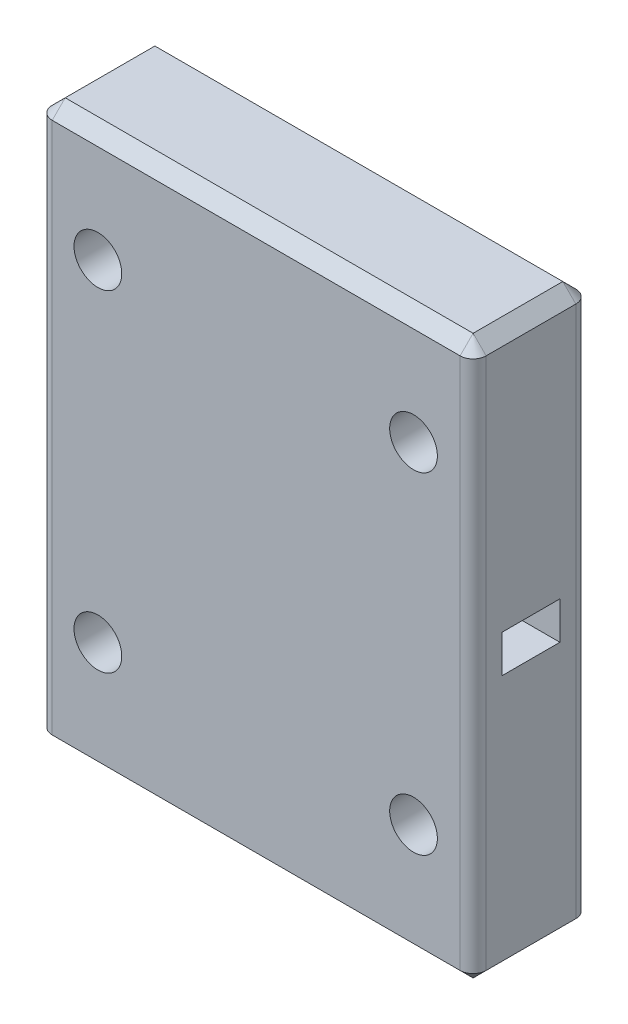
ISO-10303-21;
HEADER;
FILE_DESCRIPTION(('STEP AP214'),'2;1');
FILE_NAME('part.step','',(''),(''),'','','');
FILE_SCHEMA(('AUTOMOTIVE_DESIGN { 1 0 10303 214 1 1 1 1 }'));
ENDSEC;
DATA;
#1=APPLICATION_CONTEXT('core data for automotive mechanical design processes');
#2=APPLICATION_PROTOCOL_DEFINITION('international standard','automotive_design',2000,#1);
#3=PRODUCT_CONTEXT('',#1,'mechanical');
#4=PRODUCT('Part','Part','',(#3));
#5=PRODUCT_RELATED_PRODUCT_CATEGORY('part','',(#4));
#6=PRODUCT_DEFINITION_FORMATION('','',#4);
#7=PRODUCT_DEFINITION_CONTEXT('part definition',#1,'design');
#8=PRODUCT_DEFINITION('design','',#6,#7);
#9=PRODUCT_DEFINITION_SHAPE('','',#8);
#10=(LENGTH_UNIT() NAMED_UNIT(*) SI_UNIT(.MILLI.,.METRE.));
#11=(NAMED_UNIT(*) PLANE_ANGLE_UNIT() SI_UNIT($,.RADIAN.));
#12=(NAMED_UNIT(*) SI_UNIT($,.STERADIAN.) SOLID_ANGLE_UNIT());
#13=UNCERTAINTY_MEASURE_WITH_UNIT(LENGTH_MEASURE(1.E-05),#10,'distance_accuracy_value','');
#14=(GEOMETRIC_REPRESENTATION_CONTEXT(3) GLOBAL_UNCERTAINTY_ASSIGNED_CONTEXT((#13)) GLOBAL_UNIT_ASSIGNED_CONTEXT((#10,
#11,#12)) REPRESENTATION_CONTEXT('',''));
#15=CARTESIAN_POINT('',(0.,0.,0.));
#16=DIRECTION('',(0.,0.,1.));
#17=DIRECTION('',(1.,0.,0.));
#18=AXIS2_PLACEMENT_3D('',#15,#16,#17);
#19=CARTESIAN_POINT('',(15.0433857381665,64.262,1.57056150970451));
#20=DIRECTION('',(0.,-1.,0.));
#21=DIRECTION('',(0.,0.,-1.));
#22=AXIS2_PLACEMENT_3D('',#19,#20,#21);
#23=CYLINDRICAL_SURFACE('',#22,1.143);
#24=DIRECTION('',(0.,-1.,0.));
#25=VECTOR('',#24,1.);
#26=CARTESIAN_POINT('',(16.1863857381665,64.262,1.57056150970451));
#27=LINE('',#26,#25);
#28=CARTESIAN_POINT('',(16.1863857381665,63.119,1.57056150970451));
#29=VERTEX_POINT('',#28);
#30=CARTESIAN_POINT('',(16.1863857381665,16.383,1.57056150970451));
#31=VERTEX_POINT('',#30);
#32=EDGE_CURVE('E196',#29,#31,#27,.T.);
#33=ORIENTED_EDGE('',*,*,#32,.T.);
#34=CARTESIAN_POINT('',(15.0433857381665,16.383,1.57056150970451));
#35=DIRECTION('',(0.,-1.,0.));
#36=DIRECTION('',(0.,0.,-1.));
#37=AXIS2_PLACEMENT_3D('',#34,#35,#36);
#38=CIRCLE('',#37,1.143);
#39=CARTESIAN_POINT('',(15.0433857381665,16.383,0.427561509704508));
#40=VERTEX_POINT('',#39);
#41=EDGE_CURVE('E239',#31,#40,#38,.F.);
#42=ORIENTED_EDGE('',*,*,#41,.T.);
#43=DIRECTION('',(0.,-1.,0.));
#44=VECTOR('',#43,1.);
#45=CARTESIAN_POINT('',(15.0433857381665,64.262,0.427561509704508));
#46=LINE('',#45,#44);
#47=CARTESIAN_POINT('',(15.0433857381665,63.119,0.427561509704508));
#48=VERTEX_POINT('',#47);
#49=EDGE_CURVE('E220',#48,#40,#46,.T.);
#50=ORIENTED_EDGE('',*,*,#49,.F.);
#51=CARTESIAN_POINT('',(15.0433857381665,63.119,1.57056150970451));
#52=DIRECTION('',(0.,-1.,0.));
#53=DIRECTION('',(0.,0.,-1.));
#54=AXIS2_PLACEMENT_3D('',#51,#52,#53);
#55=CIRCLE('',#54,1.143);
#56=EDGE_CURVE('E237',#48,#29,#55,.T.);
#57=ORIENTED_EDGE('',*,*,#56,.T.);
#58=EDGE_LOOP('',(#33,#42,#50,#57));
#59=FACE_BOUND('',#58,.T.);
#60=ADVANCED_FACE('F36',(#59),#23,.T.);
#61=CARTESIAN_POINT('',(15.0433857381665,64.262,0.427561509704508));
#62=DIRECTION('',(0.,0.,1.));
#63=DIRECTION('',(1.,0.,0.));
#64=AXIS2_PLACEMENT_3D('',#61,#62,#63);
#65=PLANE('',#64);
#66=CARTESIAN_POINT('',(10.9541062388225,25.4254000031227,0.427561509704508));
#67=DIRECTION('',(0.,0.,-1.));
#68=DIRECTION('',(-1.,0.,0.));
#69=AXIS2_PLACEMENT_3D('',#66,#67,#68);
#70=CIRCLE('',#69,2.0955);
#71=CARTESIAN_POINT('',(8.85860623882254,25.4254000031227,0.427561509704508));
#72=VERTEX_POINT('',#71);
#73=EDGE_CURVE('E693',#72,#72,#70,.T.);
#74=ORIENTED_EDGE('',*,*,#73,.F.);
#75=EDGE_LOOP('',(#74));
#76=FACE_BOUND('',#75,.T.);
#77=CARTESIAN_POINT('',(-16.7572937614626,54.5083999971114,0.427561509704508));
#78=DIRECTION('',(0.,0.,-1.));
#79=DIRECTION('',(-1.,0.,0.));
#80=AXIS2_PLACEMENT_3D('',#77,#78,#79);
#81=CIRCLE('',#80,2.0955);
#82=CARTESIAN_POINT('',(-18.8527937614626,54.5083999971114,0.427561509704508));
#83=VERTEX_POINT('',#82);
#84=EDGE_CURVE('E695',#83,#83,#81,.T.);
#85=ORIENTED_EDGE('',*,*,#84,.F.);
#86=EDGE_LOOP('',(#85));
#87=FACE_BOUND('',#86,.T.);
#88=CARTESIAN_POINT('',(-16.7572937614626,25.4254000031227,0.427561509704508));
#89=DIRECTION('',(0.,0.,-1.));
#90=DIRECTION('',(-1.,0.,0.));
#91=AXIS2_PLACEMENT_3D('',#88,#89,#90);
#92=CIRCLE('',#91,2.0955);
#93=CARTESIAN_POINT('',(-18.8527937614626,25.4254000031227,0.427561509704508));
#94=VERTEX_POINT('',#93);
#95=EDGE_CURVE('E707',#94,#94,#92,.T.);
#96=ORIENTED_EDGE('',*,*,#95,.F.);
#97=EDGE_LOOP('',(#96));
#98=FACE_BOUND('',#97,.T.);
#99=CARTESIAN_POINT('',(10.9541062388225,54.5083999971114,0.427561509704508));
#100=DIRECTION('',(0.,0.,-1.));
#101=DIRECTION('',(-1.,0.,0.));
#102=AXIS2_PLACEMENT_3D('',#99,#100,#101);
#103=CIRCLE('',#102,2.0955);
#104=CARTESIAN_POINT('',(8.85860623882255,54.5083999971114,0.427561509704508));
#105=VERTEX_POINT('',#104);
#106=EDGE_CURVE('E700',#105,#105,#103,.T.);
#107=ORIENTED_EDGE('',*,*,#106,.F.);
#108=EDGE_LOOP('',(#107));
#109=FACE_BOUND('',#108,.T.);
#110=ORIENTED_EDGE('',*,*,#49,.T.);
#111=DIRECTION('',(-1.,0.,0.));
#112=VECTOR('',#111,1.);
#113=CARTESIAN_POINT('',(-20.7706142618335,16.383,0.427561509704508));
#114=LINE('',#113,#112);
#115=CARTESIAN_POINT('',(-20.7706142618335,16.383,0.427561509704508));
#116=VERTEX_POINT('',#115);
#117=EDGE_CURVE('E248',#40,#116,#114,.T.);
#118=ORIENTED_EDGE('',*,*,#117,.T.);
#119=DIRECTION('',(0.,-1.,0.));
#120=VECTOR('',#119,1.);
#121=CARTESIAN_POINT('',(-20.7706142618335,64.262,0.427561509704508));
#122=LINE('',#121,#120);
#123=CARTESIAN_POINT('',(-20.7706142618335,63.119,0.427561509704508));
#124=VERTEX_POINT('',#123);
#125=EDGE_CURVE('E217',#124,#116,#122,.T.);
#126=ORIENTED_EDGE('',*,*,#125,.F.);
#127=DIRECTION('',(1.,0.,0.));
#128=VECTOR('',#127,1.);
#129=CARTESIAN_POINT('',(15.0433857381665,63.119,0.427561509704508));
#130=LINE('',#129,#128);
#131=EDGE_CURVE('E245',#124,#48,#130,.T.);
#132=ORIENTED_EDGE('',*,*,#131,.T.);
#133=EDGE_LOOP('',(#110,#118,#126,#132));
#134=FACE_BOUND('',#133,.T.);
#135=ADVANCED_FACE('F360',(#76,#87,#98,#109,#134),#65,.F.);
#136=CARTESIAN_POINT('',(-20.7706142618335,64.262,1.57056150970451));
#137=DIRECTION('',(0.,-1.,0.));
#138=DIRECTION('',(0.,0.,-1.));
#139=AXIS2_PLACEMENT_3D('',#136,#137,#138);
#140=CYLINDRICAL_SURFACE('',#139,1.143);
#141=ORIENTED_EDGE('',*,*,#125,.T.);
#142=CARTESIAN_POINT('',(-20.7706142618335,16.383,1.57056150970451));
#143=DIRECTION('',(0.,-1.,0.));
#144=DIRECTION('',(0.,0.,-1.));
#145=AXIS2_PLACEMENT_3D('',#142,#143,#144);
#146=CIRCLE('',#145,1.143);
#147=CARTESIAN_POINT('',(-21.9136142618335,16.383,1.57056150970451));
#148=VERTEX_POINT('',#147);
#149=EDGE_CURVE('E256',#116,#148,#146,.F.);
#150=ORIENTED_EDGE('',*,*,#149,.T.);
#151=DIRECTION('',(0.,-1.,0.));
#152=VECTOR('',#151,1.);
#153=CARTESIAN_POINT('',(-21.9136142618335,64.262,1.57056150970451));
#154=LINE('',#153,#152);
#155=CARTESIAN_POINT('',(-21.9136142618335,63.119,1.57056150970451));
#156=VERTEX_POINT('',#155);
#157=EDGE_CURVE('E214',#156,#148,#154,.T.);
#158=ORIENTED_EDGE('',*,*,#157,.F.);
#159=CARTESIAN_POINT('',(-20.7706142618335,63.119,1.57056150970451));
#160=DIRECTION('',(0.,-1.,0.));
#161=DIRECTION('',(0.,0.,-1.));
#162=AXIS2_PLACEMENT_3D('',#159,#160,#161);
#163=CIRCLE('',#162,1.143);
#164=EDGE_CURVE('E254',#156,#124,#163,.T.);
#165=ORIENTED_EDGE('',*,*,#164,.T.);
#166=EDGE_LOOP('',(#141,#150,#158,#165));
#167=FACE_BOUND('',#166,.T.);
#168=ADVANCED_FACE('F372',(#167),#140,.T.);
#169=CARTESIAN_POINT('',(-21.9136142618335,64.262,1.57056150970451));
#170=DIRECTION('',(1.,0.,0.));
#171=DIRECTION('',(0.,0.,-1.));
#172=AXIS2_PLACEMENT_3D('',#169,#170,#171);
#173=PLANE('',#172);
#174=ORIENTED_EDGE('',*,*,#157,.T.);
#175=DIRECTION('',(0.,0.,1.));
#176=VECTOR('',#175,1.);
#177=CARTESIAN_POINT('',(-21.9136142618335,16.383,9.4445615097045));
#178=LINE('',#177,#176);
#179=CARTESIAN_POINT('',(-21.9136142618335,16.383,9.4445615097045));
#180=VERTEX_POINT('',#179);
#181=EDGE_CURVE('E264',#148,#180,#178,.T.);
#182=ORIENTED_EDGE('',*,*,#181,.T.);
#183=DIRECTION('',(0.,-1.,0.));
#184=VECTOR('',#183,1.);
#185=CARTESIAN_POINT('',(-21.9136142618335,64.262,9.4445615097045));
#186=LINE('',#185,#184);
#187=CARTESIAN_POINT('',(-21.9136142618335,63.119,9.4445615097045));
#188=VERTEX_POINT('',#187);
#189=EDGE_CURVE('E211',#188,#180,#186,.T.);
#190=ORIENTED_EDGE('',*,*,#189,.F.);
#191=DIRECTION('',(0.,0.,-1.));
#192=VECTOR('',#191,1.);
#193=CARTESIAN_POINT('',(-21.9136142618335,63.119,1.57056150970451));
#194=LINE('',#193,#192);
#195=EDGE_CURVE('E262',#188,#156,#194,.T.);
#196=ORIENTED_EDGE('',*,*,#195,.T.);
#197=EDGE_LOOP('',(#174,#182,#190,#196));
#198=FACE_BOUND('',#197,.T.);
#199=ADVANCED_FACE('F376',(#198),#173,.F.);
#200=CARTESIAN_POINT('',(-20.7706142618335,64.262,9.4445615097045));
#201=DIRECTION('',(0.,-1.,0.));
#202=DIRECTION('',(0.,0.,-1.));
#203=AXIS2_PLACEMENT_3D('',#200,#201,#202);
#204=CYLINDRICAL_SURFACE('',#203,1.143);
#205=ORIENTED_EDGE('',*,*,#189,.T.);
#206=CARTESIAN_POINT('',(-20.7706142618335,16.383,9.4445615097045));
#207=DIRECTION('',(0.,-1.,0.));
#208=DIRECTION('',(0.,0.,-1.));
#209=AXIS2_PLACEMENT_3D('',#206,#207,#208);
#210=CIRCLE('',#209,1.143);
#211=CARTESIAN_POINT('',(-20.7706142618335,16.383,10.5875615097045));
#212=VERTEX_POINT('',#211);
#213=EDGE_CURVE('E260',#180,#212,#210,.F.);
#214=ORIENTED_EDGE('',*,*,#213,.T.);
#215=DIRECTION('',(0.,-1.,0.));
#216=VECTOR('',#215,1.);
#217=CARTESIAN_POINT('',(-20.7706142618335,64.262,10.5875615097045));
#218=LINE('',#217,#216);
#219=CARTESIAN_POINT('',(-20.7706142618335,63.119,10.5875615097045));
#220=VERTEX_POINT('',#219);
#221=EDGE_CURVE('E208',#220,#212,#218,.T.);
#222=ORIENTED_EDGE('',*,*,#221,.F.);
#223=CARTESIAN_POINT('',(-20.7706142618335,63.119,9.4445615097045));
#224=DIRECTION('',(0.,-1.,0.));
#225=DIRECTION('',(0.,0.,-1.));
#226=AXIS2_PLACEMENT_3D('',#223,#224,#225);
#227=CIRCLE('',#226,1.143);
#228=EDGE_CURVE('E258',#220,#188,#227,.T.);
#229=ORIENTED_EDGE('',*,*,#228,.T.);
#230=EDGE_LOOP('',(#205,#214,#222,#229));
#231=FACE_BOUND('',#230,.T.);
#232=ADVANCED_FACE('F325',(#231),#204,.T.);
#233=CARTESIAN_POINT('',(15.0433857381665,64.262,10.5875615097045));
#234=DIRECTION('',(0.,0.,-1.));
#235=DIRECTION('',(-1.,0.,0.));
#236=AXIS2_PLACEMENT_3D('',#233,#234,#235);
#237=PLANE('',#236);
#238=CARTESIAN_POINT('',(10.9541062388225,25.4254000031227,10.5875615097045));
#239=DIRECTION('',(0.,0.,-1.));
#240=DIRECTION('',(-1.,0.,0.));
#241=AXIS2_PLACEMENT_3D('',#238,#239,#240);
#242=CIRCLE('',#241,2.0955);
#243=CARTESIAN_POINT('',(8.85860623882254,25.4254000031227,10.5875615097045));
#244=VERTEX_POINT('',#243);
#245=EDGE_CURVE('E690',#244,#244,#242,.F.);
#246=ORIENTED_EDGE('',*,*,#245,.F.);
#247=EDGE_LOOP('',(#246));
#248=FACE_BOUND('',#247,.T.);
#249=CARTESIAN_POINT('',(-16.7572937614626,54.5083999971114,10.5875615097045));
#250=DIRECTION('',(0.,0.,-1.));
#251=DIRECTION('',(-1.,0.,0.));
#252=AXIS2_PLACEMENT_3D('',#249,#250,#251);
#253=CIRCLE('',#252,2.0955);
#254=CARTESIAN_POINT('',(-18.8527937614626,54.5083999971114,10.5875615097045));
#255=VERTEX_POINT('',#254);
#256=EDGE_CURVE('E698',#255,#255,#253,.F.);
#257=ORIENTED_EDGE('',*,*,#256,.F.);
#258=EDGE_LOOP('',(#257));
#259=FACE_BOUND('',#258,.T.);
#260=CARTESIAN_POINT('',(-16.7572937614626,25.4254000031227,10.5875615097045));
#261=DIRECTION('',(0.,0.,-1.));
#262=DIRECTION('',(-1.,0.,0.));
#263=AXIS2_PLACEMENT_3D('',#260,#261,#262);
#264=CIRCLE('',#263,2.0955);
#265=CARTESIAN_POINT('',(-18.8527937614626,25.4254000031227,10.5875615097045));
#266=VERTEX_POINT('',#265);
#267=EDGE_CURVE('E702',#266,#266,#264,.F.);
#268=ORIENTED_EDGE('',*,*,#267,.F.);
#269=EDGE_LOOP('',(#268));
#270=FACE_BOUND('',#269,.T.);
#271=CARTESIAN_POINT('',(10.9541062388225,54.5083999971114,10.5875615097045));
#272=DIRECTION('',(0.,0.,-1.));
#273=DIRECTION('',(-1.,0.,0.));
#274=AXIS2_PLACEMENT_3D('',#271,#272,#273);
#275=CIRCLE('',#274,2.0955);
#276=CARTESIAN_POINT('',(8.85860623882255,54.5083999971114,10.5875615097045));
#277=VERTEX_POINT('',#276);
#278=EDGE_CURVE('E183',#277,#277,#275,.F.);
#279=ORIENTED_EDGE('',*,*,#278,.F.);
#280=EDGE_LOOP('',(#279));
#281=FACE_BOUND('',#280,.T.);
#282=ORIENTED_EDGE('',*,*,#221,.T.);
#283=DIRECTION('',(1.,0.,0.));
#284=VECTOR('',#283,1.);
#285=CARTESIAN_POINT('',(15.0433857381665,16.383,10.5875615097045));
#286=LINE('',#285,#284);
#287=CARTESIAN_POINT('',(15.0433857381665,16.383,10.5875615097045));
#288=VERTEX_POINT('',#287);
#289=EDGE_CURVE('E252',#212,#288,#286,.T.);
#290=ORIENTED_EDGE('',*,*,#289,.T.);
#291=DIRECTION('',(0.,-1.,0.));
#292=VECTOR('',#291,1.);
#293=CARTESIAN_POINT('',(15.0433857381665,64.262,10.5875615097045));
#294=LINE('',#293,#292);
#295=CARTESIAN_POINT('',(15.0433857381665,63.119,10.5875615097045));
#296=VERTEX_POINT('',#295);
#297=EDGE_CURVE('E205',#296,#288,#294,.T.);
#298=ORIENTED_EDGE('',*,*,#297,.F.);
#299=DIRECTION('',(-1.,0.,0.));
#300=VECTOR('',#299,1.);
#301=CARTESIAN_POINT('',(15.0433857381665,63.119,10.5875615097045));
#302=LINE('',#301,#300);
#303=EDGE_CURVE('E250',#296,#220,#302,.T.);
#304=ORIENTED_EDGE('',*,*,#303,.T.);
#305=EDGE_LOOP('',(#282,#290,#298,#304));
#306=FACE_BOUND('',#305,.T.);
#307=ADVANCED_FACE('F322',(#248,#259,#270,#281,#306),#237,.F.);
#308=CARTESIAN_POINT('',(15.0433857381665,64.262,9.4445615097045));
#309=DIRECTION('',(0.,-1.,0.));
#310=DIRECTION('',(0.,0.,-1.));
#311=AXIS2_PLACEMENT_3D('',#308,#309,#310);
#312=CYLINDRICAL_SURFACE('',#311,1.143);
#313=ORIENTED_EDGE('',*,*,#297,.T.);
#314=CARTESIAN_POINT('',(15.0433857381665,16.383,9.4445615097045));
#315=DIRECTION('',(0.,-1.,0.));
#316=DIRECTION('',(0.,0.,-1.));
#317=AXIS2_PLACEMENT_3D('',#314,#315,#316);
#318=CIRCLE('',#317,1.143);
#319=CARTESIAN_POINT('',(16.1863857381665,16.383,9.4445615097045));
#320=VERTEX_POINT('',#319);
#321=EDGE_CURVE('E243',#288,#320,#318,.F.);
#322=ORIENTED_EDGE('',*,*,#321,.T.);
#323=DIRECTION('',(0.,-1.,0.));
#324=VECTOR('',#323,1.);
#325=CARTESIAN_POINT('',(16.1863857381665,64.262,9.4445615097045));
#326=LINE('',#325,#324);
#327=CARTESIAN_POINT('',(16.1863857381665,63.119,9.4445615097045));
#328=VERTEX_POINT('',#327);
#329=EDGE_CURVE('E202',#328,#320,#326,.T.);
#330=ORIENTED_EDGE('',*,*,#329,.F.);
#331=CARTESIAN_POINT('',(15.0433857381665,63.119,9.4445615097045));
#332=DIRECTION('',(0.,-1.,0.));
#333=DIRECTION('',(0.,0.,-1.));
#334=AXIS2_PLACEMENT_3D('',#331,#332,#333);
#335=CIRCLE('',#334,1.143);
#336=EDGE_CURVE('E241',#328,#296,#335,.T.);
#337=ORIENTED_EDGE('',*,*,#336,.T.);
#338=EDGE_LOOP('',(#313,#322,#330,#337));
#339=FACE_BOUND('',#338,.T.);
#340=ADVANCED_FACE('F338',(#339),#312,.T.);
#341=CARTESIAN_POINT('',(16.1863857381665,64.262,1.57056150970451));
#342=DIRECTION('',(-1.,0.,0.));
#343=DIRECTION('',(0.,0.,1.));
#344=AXIS2_PLACEMENT_3D('',#341,#342,#343);
#345=PLANE('',#344);
#346=DIRECTION('',(0.,0.,-1.));
#347=VECTOR('',#346,1.);
#348=CARTESIAN_POINT('',(16.1863857381665,38.1,8.0475615097045));
#349=LINE('',#348,#347);
#350=CARTESIAN_POINT('',(16.1863857381665,38.1,8.0475615097045));
#351=VERTEX_POINT('',#350);
#352=CARTESIAN_POINT('',(16.1863857381665,38.1,2.96756150970451));
#353=VERTEX_POINT('',#352);
#354=EDGE_CURVE('E189',#351,#353,#349,.T.);
#355=ORIENTED_EDGE('',*,*,#354,.F.);
#356=DIRECTION('',(0.,-1.,0.));
#357=VECTOR('',#356,1.);
#358=CARTESIAN_POINT('',(16.1863857381665,41.402,8.04756150970451));
#359=LINE('',#358,#357);
#360=CARTESIAN_POINT('',(16.1863857381665,41.402,8.04756150970451));
#361=VERTEX_POINT('',#360);
#362=EDGE_CURVE('E160',#361,#351,#359,.T.);
#363=ORIENTED_EDGE('',*,*,#362,.F.);
#364=DIRECTION('',(0.,0.,1.));
#365=VECTOR('',#364,1.);
#366=CARTESIAN_POINT('',(16.1863857381665,41.402,8.04756150970451));
#367=LINE('',#366,#365);
#368=CARTESIAN_POINT('',(16.1863857381665,41.402,2.96756150970451));
#369=VERTEX_POINT('',#368);
#370=EDGE_CURVE('E177',#369,#361,#367,.T.);
#371=ORIENTED_EDGE('',*,*,#370,.F.);
#372=DIRECTION('',(0.,1.,0.));
#373=VECTOR('',#372,1.);
#374=CARTESIAN_POINT('',(16.1863857381665,41.402,2.96756150970451));
#375=LINE('',#374,#373);
#376=EDGE_CURVE('E180',#353,#369,#375,.T.);
#377=ORIENTED_EDGE('',*,*,#376,.F.);
#378=EDGE_LOOP('',(#355,#363,#371,#377));
#379=FACE_BOUND('',#378,.T.);
#380=ORIENTED_EDGE('',*,*,#329,.T.);
#381=DIRECTION('',(0.,0.,-1.));
#382=VECTOR('',#381,1.);
#383=CARTESIAN_POINT('',(16.1863857381665,16.383,1.57056150970451));
#384=LINE('',#383,#382);
#385=EDGE_CURVE('E225',#320,#31,#384,.T.);
#386=ORIENTED_EDGE('',*,*,#385,.T.);
#387=ORIENTED_EDGE('',*,*,#32,.F.);
#388=DIRECTION('',(0.,0.,1.));
#389=VECTOR('',#388,1.);
#390=CARTESIAN_POINT('',(16.1863857381665,63.119,1.57056150970451));
#391=LINE('',#390,#389);
#392=EDGE_CURVE('E223',#29,#328,#391,.T.);
#393=ORIENTED_EDGE('',*,*,#392,.T.);
#394=EDGE_LOOP('',(#380,#386,#387,#393));
#395=FACE_BOUND('',#394,.T.);
#396=ADVANCED_FACE('F342',(#379,#395),#345,.F.);
#397=CARTESIAN_POINT('',(15.0433857381665,64.262,1.57056150970451));
#398=DIRECTION('',(0.,-1.,0.));
#399=DIRECTION('',(0.,0.,-1.));
#400=AXIS2_PLACEMENT_3D('',#397,#398,#399);
#401=PLANE('',#400);
#402=DIRECTION('',(0.,0.,-1.));
#403=VECTOR('',#402,1.);
#404=CARTESIAN_POINT('',(15.0433857381665,64.262,1.57056150970451));
#405=LINE('',#404,#403);
#406=CARTESIAN_POINT('',(15.0433857381665,64.262,9.4445615097045));
#407=VERTEX_POINT('',#406);
#408=CARTESIAN_POINT('',(15.0433857381665,64.262,1.57056150970451));
#409=VERTEX_POINT('',#408);
#410=EDGE_CURVE('E60',#407,#409,#405,.T.);
#411=ORIENTED_EDGE('',*,*,#410,.T.);
#412=DIRECTION('',(-1.,0.,0.));
#413=VECTOR('',#412,1.);
#414=CARTESIAN_POINT('',(15.0433857381665,64.262,1.57056150970451));
#415=LINE('',#414,#413);
#416=CARTESIAN_POINT('',(-20.7706142618335,64.262,1.57056150970451));
#417=VERTEX_POINT('',#416);
#418=EDGE_CURVE('E11',#409,#417,#415,.T.);
#419=ORIENTED_EDGE('',*,*,#418,.T.);
#420=DIRECTION('',(0.,0.,1.));
#421=VECTOR('',#420,1.);
#422=CARTESIAN_POINT('',(-20.7706142618335,64.262,1.57056150970451));
#423=LINE('',#422,#421);
#424=CARTESIAN_POINT('',(-20.7706142618335,64.262,9.4445615097045));
#425=VERTEX_POINT('',#424);
#426=EDGE_CURVE('E45',#417,#425,#423,.T.);
#427=ORIENTED_EDGE('',*,*,#426,.T.);
#428=DIRECTION('',(1.,0.,0.));
#429=VECTOR('',#428,1.);
#430=CARTESIAN_POINT('',(15.0433857381665,64.262,9.4445615097045));
#431=LINE('',#430,#429);
#432=EDGE_CURVE('E266',#425,#407,#431,.T.);
#433=ORIENTED_EDGE('',*,*,#432,.T.);
#434=EDGE_LOOP('',(#411,#419,#427,#433));
#435=FACE_BOUND('',#434,.T.);
#436=ADVANCED_FACE('F384',(#435),#401,.F.);
#437=CARTESIAN_POINT('',(15.0433857381665,15.24,1.57056150970451));
#438=DIRECTION('',(0.,-1.,0.));
#439=DIRECTION('',(0.,0.,-1.));
#440=AXIS2_PLACEMENT_3D('',#437,#438,#439);
#441=PLANE('',#440);
#442=DIRECTION('',(1.,0.,0.));
#443=VECTOR('',#442,1.);
#444=CARTESIAN_POINT('',(15.0433857381665,15.24,1.57056150970451));
#445=LINE('',#444,#443);
#446=CARTESIAN_POINT('',(-20.7706142618335,15.24,1.57056150970451));
#447=VERTEX_POINT('',#446);
#448=CARTESIAN_POINT('',(15.0433857381665,15.24,1.57056150970451));
#449=VERTEX_POINT('',#448);
#450=EDGE_CURVE('E232',#447,#449,#445,.T.);
#451=ORIENTED_EDGE('',*,*,#450,.T.);
#452=DIRECTION('',(0.,0.,1.));
#453=VECTOR('',#452,1.);
#454=CARTESIAN_POINT('',(15.0433857381665,15.24,9.4445615097045));
#455=LINE('',#454,#453);
#456=CARTESIAN_POINT('',(15.0433857381665,15.24,9.44456150970449));
#457=VERTEX_POINT('',#456);
#458=EDGE_CURVE('E234',#449,#457,#455,.T.);
#459=ORIENTED_EDGE('',*,*,#458,.T.);
#460=DIRECTION('',(-1.,0.,0.));
#461=VECTOR('',#460,1.);
#462=CARTESIAN_POINT('',(-20.7706142618335,15.24,9.44456150970449));
#463=LINE('',#462,#461);
#464=CARTESIAN_POINT('',(-20.7706142618335,15.24,9.4445615097045));
#465=VERTEX_POINT('',#464);
#466=EDGE_CURVE('E230',#457,#465,#463,.T.);
#467=ORIENTED_EDGE('',*,*,#466,.T.);
#468=DIRECTION('',(0.,0.,-1.));
#469=VECTOR('',#468,1.);
#470=CARTESIAN_POINT('',(-20.7706142618335,15.24,1.57056150970451));
#471=LINE('',#470,#469);
#472=EDGE_CURVE('E228',#465,#447,#471,.T.);
#473=ORIENTED_EDGE('',*,*,#472,.T.);
#474=EDGE_LOOP('',(#451,#459,#467,#473));
#475=FACE_BOUND('',#474,.T.);
#476=ADVANCED_FACE('F382',(#475),#441,.T.);
#477=CARTESIAN_POINT('',(8.56638573816653,41.402,8.04756150970451));
#478=DIRECTION('',(0.,0.,1.));
#479=DIRECTION('',(0.,-1.,0.));
#480=AXIS2_PLACEMENT_3D('',#477,#478,#479);
#481=PLANE('',#480);
#482=ORIENTED_EDGE('',*,*,#362,.T.);
#483=DIRECTION('',(1.,0.,0.));
#484=VECTOR('',#483,1.);
#485=CARTESIAN_POINT('',(8.56638573816653,38.1,8.0475615097045));
#486=LINE('',#485,#484);
#487=CARTESIAN_POINT('',(8.56638573816653,38.1,8.0475615097045));
#488=VERTEX_POINT('',#487);
#489=EDGE_CURVE('E153',#488,#351,#486,.T.);
#490=ORIENTED_EDGE('',*,*,#489,.F.);
#491=DIRECTION('',(0.,-1.,0.));
#492=VECTOR('',#491,1.);
#493=CARTESIAN_POINT('',(8.56638573816653,41.402,8.04756150970451));
#494=LINE('',#493,#492);
#495=CARTESIAN_POINT('',(8.56638573816653,41.402,8.04756150970451));
#496=VERTEX_POINT('',#495);
#497=EDGE_CURVE('E157',#496,#488,#494,.T.);
#498=ORIENTED_EDGE('',*,*,#497,.F.);
#499=DIRECTION('',(1.,0.,0.));
#500=VECTOR('',#499,1.);
#501=CARTESIAN_POINT('',(8.56638573816653,41.402,8.04756150970451));
#502=LINE('',#501,#500);
#503=EDGE_CURVE('E194',#496,#361,#502,.T.);
#504=ORIENTED_EDGE('',*,*,#503,.T.);
#505=EDGE_LOOP('',(#482,#490,#498,#504));
#506=FACE_BOUND('',#505,.T.);
#507=ADVANCED_FACE('F155',(#506),#481,.F.);
#508=CARTESIAN_POINT('',(8.56638573816653,41.402,8.04756150970451));
#509=DIRECTION('',(0.,1.,0.));
#510=DIRECTION('',(0.,0.,1.));
#511=AXIS2_PLACEMENT_3D('',#508,#509,#510);
#512=PLANE('',#511);
#513=ORIENTED_EDGE('',*,*,#370,.T.);
#514=ORIENTED_EDGE('',*,*,#503,.F.);
#515=DIRECTION('',(0.,0.,1.));
#516=VECTOR('',#515,1.);
#517=CARTESIAN_POINT('',(8.56638573816653,41.402,8.04756150970451));
#518=LINE('',#517,#516);
#519=CARTESIAN_POINT('',(8.56638573816653,41.402,2.96756150970451));
#520=VERTEX_POINT('',#519);
#521=EDGE_CURVE('E165',#520,#496,#518,.T.);
#522=ORIENTED_EDGE('',*,*,#521,.F.);
#523=DIRECTION('',(1.,0.,0.));
#524=VECTOR('',#523,1.);
#525=CARTESIAN_POINT('',(8.56638573816653,41.402,2.96756150970451));
#526=LINE('',#525,#524);
#527=EDGE_CURVE('E197',#520,#369,#526,.T.);
#528=ORIENTED_EDGE('',*,*,#527,.T.);
#529=EDGE_LOOP('',(#513,#514,#522,#528));
#530=FACE_BOUND('',#529,.T.);
#531=ADVANCED_FACE('F390',(#530),#512,.F.);
#532=CARTESIAN_POINT('',(8.56638573816653,41.402,2.96756150970451));
#533=DIRECTION('',(0.,0.,-1.));
#534=DIRECTION('',(0.,1.,0.));
#535=AXIS2_PLACEMENT_3D('',#532,#533,#534);
#536=PLANE('',#535);
#537=ORIENTED_EDGE('',*,*,#376,.T.);
#538=ORIENTED_EDGE('',*,*,#527,.F.);
#539=DIRECTION('',(0.,1.,0.));
#540=VECTOR('',#539,1.);
#541=CARTESIAN_POINT('',(8.56638573816653,41.402,2.96756150970451));
#542=LINE('',#541,#540);
#543=CARTESIAN_POINT('',(8.56638573816653,38.1,2.96756150970451));
#544=VERTEX_POINT('',#543);
#545=EDGE_CURVE('E173',#544,#520,#542,.T.);
#546=ORIENTED_EDGE('',*,*,#545,.F.);
#547=DIRECTION('',(1.,0.,0.));
#548=VECTOR('',#547,1.);
#549=CARTESIAN_POINT('',(8.56638573816653,38.1,2.96756150970451));
#550=LINE('',#549,#548);
#551=EDGE_CURVE('E164',#544,#353,#550,.T.);
#552=ORIENTED_EDGE('',*,*,#551,.T.);
#553=EDGE_LOOP('',(#537,#538,#546,#552));
#554=FACE_BOUND('',#553,.T.);
#555=ADVANCED_FACE('F501',(#554),#536,.F.);
#556=CARTESIAN_POINT('',(8.56638573816653,38.1,8.0475615097045));
#557=DIRECTION('',(0.,-1.,0.));
#558=DIRECTION('',(0.,0.,-1.));
#559=AXIS2_PLACEMENT_3D('',#556,#557,#558);
#560=PLANE('',#559);
#561=ORIENTED_EDGE('',*,*,#354,.T.);
#562=ORIENTED_EDGE('',*,*,#551,.F.);
#563=DIRECTION('',(0.,0.,-1.));
#564=VECTOR('',#563,1.);
#565=CARTESIAN_POINT('',(8.56638573816653,38.1,8.0475615097045));
#566=LINE('',#565,#564);
#567=EDGE_CURVE('E168',#488,#544,#566,.T.);
#568=ORIENTED_EDGE('',*,*,#567,.F.);
#569=ORIENTED_EDGE('',*,*,#489,.T.);
#570=EDGE_LOOP('',(#561,#562,#568,#569));
#571=FACE_BOUND('',#570,.T.);
#572=ADVANCED_FACE('F169',(#571),#560,.F.);
#573=CARTESIAN_POINT('',(8.56638573816653,0.,0.));
#574=DIRECTION('',(1.,0.,0.));
#575=DIRECTION('',(0.,0.,-1.));
#576=AXIS2_PLACEMENT_3D('',#573,#574,#575);
#577=PLANE('',#576);
#578=ORIENTED_EDGE('',*,*,#497,.T.);
#579=ORIENTED_EDGE('',*,*,#567,.T.);
#580=ORIENTED_EDGE('',*,*,#545,.T.);
#581=ORIENTED_EDGE('',*,*,#521,.T.);
#582=EDGE_LOOP('',(#578,#579,#580,#581));
#583=FACE_BOUND('',#582,.T.);
#584=ADVANCED_FACE('F175',(#583),#577,.T.);
#585=CARTESIAN_POINT('',(-21.9136142618335,16.383,1.57056150970451));
#586=DIRECTION('',(-0.707106781186547,-0.707106781186548,0.));
#587=DIRECTION('',(0.,0.,-1.));
#588=AXIS2_PLACEMENT_3D('',#585,#586,#587);
#589=PLANE('',#588);
#590=DIRECTION('',(0.707106781186548,-0.707106781186547,0.));
#591=VECTOR('',#590,1.);
#592=CARTESIAN_POINT('',(-21.9136142618335,16.383,9.4445615097045));
#593=LINE('',#592,#591);
#594=EDGE_CURVE('E190',#180,#465,#593,.T.);
#595=ORIENTED_EDGE('',*,*,#594,.F.);
#596=ORIENTED_EDGE('',*,*,#181,.F.);
#597=DIRECTION('',(-0.707106781186548,0.707106781186547,0.));
#598=VECTOR('',#597,1.);
#599=CARTESIAN_POINT('',(-20.7706142618335,15.24,1.57056150970451));
#600=LINE('',#599,#598);
#601=EDGE_CURVE('E286',#447,#148,#600,.T.);
#602=ORIENTED_EDGE('',*,*,#601,.F.);
#603=ORIENTED_EDGE('',*,*,#472,.F.);
#604=EDGE_LOOP('',(#595,#596,#602,#603));
#605=FACE_BOUND('',#604,.T.);
#606=ADVANCED_FACE('F379',(#605),#589,.T.);
#607=CARTESIAN_POINT('',(-20.7706142618335,16.383,9.4445615097045));
#608=DIRECTION('',(0.,1.,0.));
#609=DIRECTION('',(0.,0.,1.));
#610=AXIS2_PLACEMENT_3D('',#607,#608,#609);
#611=CONICAL_SURFACE('',#610,1.14300000000001,0.785398163397449);
#612=ORIENTED_EDGE('',*,*,#213,.F.);
#613=ORIENTED_EDGE('',*,*,#594,.T.);
#614=DIRECTION('',(0.,-0.707106781186547,-0.707106781186547));
#615=VECTOR('',#614,1.);
#616=CARTESIAN_POINT('',(-20.7706142618335,16.383,10.5875615097045));
#617=LINE('',#616,#615);
#618=EDGE_CURVE('E283',#212,#465,#617,.T.);
#619=ORIENTED_EDGE('',*,*,#618,.F.);
#620=EDGE_LOOP('',(#612,#613,#619));
#621=FACE_BOUND('',#620,.T.);
#622=ADVANCED_FACE('F330',(#621),#611,.T.);
#623=CARTESIAN_POINT('',(-20.7706142618335,16.383,1.57056150970451));
#624=DIRECTION('',(0.,1.,0.));
#625=DIRECTION('',(0.,0.,1.));
#626=AXIS2_PLACEMENT_3D('',#623,#624,#625);
#627=CONICAL_SURFACE('',#626,1.14300000000001,0.785398163397449);
#628=ORIENTED_EDGE('',*,*,#601,.T.);
#629=ORIENTED_EDGE('',*,*,#149,.F.);
#630=DIRECTION('',(0.,0.707106781186548,-0.707106781186547));
#631=VECTOR('',#630,1.);
#632=CARTESIAN_POINT('',(-20.7706142618335,15.24,1.57056150970451));
#633=LINE('',#632,#631);
#634=EDGE_CURVE('E280',#447,#116,#633,.T.);
#635=ORIENTED_EDGE('',*,*,#634,.F.);
#636=EDGE_LOOP('',(#628,#629,#635));
#637=FACE_BOUND('',#636,.T.);
#638=ADVANCED_FACE('F368',(#637),#627,.T.);
#639=CARTESIAN_POINT('',(15.0433857381665,16.383,10.5875615097045));
#640=DIRECTION('',(0.,-0.707106781186548,0.707106781186547));
#641=DIRECTION('',(-1.,0.,0.));
#642=AXIS2_PLACEMENT_3D('',#639,#640,#641);
#643=PLANE('',#642);
#644=ORIENTED_EDGE('',*,*,#618,.T.);
#645=ORIENTED_EDGE('',*,*,#466,.F.);
#646=DIRECTION('',(0.,-0.707106781186547,-0.707106781186548));
#647=VECTOR('',#646,1.);
#648=CARTESIAN_POINT('',(15.0433857381665,16.383,10.5875615097045));
#649=LINE('',#648,#647);
#650=EDGE_CURVE('E277',#288,#457,#649,.T.);
#651=ORIENTED_EDGE('',*,*,#650,.F.);
#652=ORIENTED_EDGE('',*,*,#289,.F.);
#653=EDGE_LOOP('',(#644,#645,#651,#652));
#654=FACE_BOUND('',#653,.T.);
#655=ADVANCED_FACE('F335',(#654),#643,.T.);
#656=CARTESIAN_POINT('',(15.0433857381665,16.383,0.427561509704508));
#657=DIRECTION('',(0.,-0.707106781186548,-0.707106781186547));
#658=DIRECTION('',(1.,0.,0.));
#659=AXIS2_PLACEMENT_3D('',#656,#657,#658);
#660=PLANE('',#659);
#661=ORIENTED_EDGE('',*,*,#634,.T.);
#662=ORIENTED_EDGE('',*,*,#117,.F.);
#663=DIRECTION('',(0.,0.707106781186547,-0.707106781186548));
#664=VECTOR('',#663,1.);
#665=CARTESIAN_POINT('',(15.0433857381665,15.24,1.57056150970451));
#666=LINE('',#665,#664);
#667=EDGE_CURVE('E274',#449,#40,#666,.T.);
#668=ORIENTED_EDGE('',*,*,#667,.F.);
#669=ORIENTED_EDGE('',*,*,#450,.F.);
#670=EDGE_LOOP('',(#661,#662,#668,#669));
#671=FACE_BOUND('',#670,.T.);
#672=ADVANCED_FACE('F363',(#671),#660,.T.);
#673=CARTESIAN_POINT('',(15.0433857381665,16.383,9.4445615097045));
#674=DIRECTION('',(0.,1.,0.));
#675=DIRECTION('',(0.,0.,1.));
#676=AXIS2_PLACEMENT_3D('',#673,#674,#675);
#677=CONICAL_SURFACE('',#676,1.14300000000001,0.785398163397449);
#678=ORIENTED_EDGE('',*,*,#321,.F.);
#679=ORIENTED_EDGE('',*,*,#650,.T.);
#680=DIRECTION('',(-0.707106781186549,-0.707106781186546,0.));
#681=VECTOR('',#680,1.);
#682=CARTESIAN_POINT('',(16.1863857381665,16.383,9.4445615097045));
#683=LINE('',#682,#681);
#684=EDGE_CURVE('E272',#320,#457,#683,.T.);
#685=ORIENTED_EDGE('',*,*,#684,.F.);
#686=EDGE_LOOP('',(#678,#679,#685));
#687=FACE_BOUND('',#686,.T.);
#688=ADVANCED_FACE('F347',(#687),#677,.T.);
#689=CARTESIAN_POINT('',(15.0433857381665,16.383,1.57056150970451));
#690=DIRECTION('',(0.,1.,0.));
#691=DIRECTION('',(0.,0.,1.));
#692=AXIS2_PLACEMENT_3D('',#689,#690,#691);
#693=CONICAL_SURFACE('',#692,1.14300000000001,0.785398163397449);
#694=ORIENTED_EDGE('',*,*,#667,.T.);
#695=ORIENTED_EDGE('',*,*,#41,.F.);
#696=DIRECTION('',(0.707106781186549,0.707106781186546,0.));
#697=VECTOR('',#696,1.);
#698=CARTESIAN_POINT('',(15.0433857381665,15.24,1.57056150970451));
#699=LINE('',#698,#697);
#700=EDGE_CURVE('E270',#449,#31,#699,.T.);
#701=ORIENTED_EDGE('',*,*,#700,.F.);
#702=EDGE_LOOP('',(#694,#695,#701));
#703=FACE_BOUND('',#702,.T.);
#704=ADVANCED_FACE('F354',(#703),#693,.T.);
#705=CARTESIAN_POINT('',(16.1863857381665,16.383,1.57056150970451));
#706=DIRECTION('',(0.707106781186547,-0.707106781186548,0.));
#707=DIRECTION('',(0.,0.,1.));
#708=AXIS2_PLACEMENT_3D('',#705,#706,#707);
#709=PLANE('',#708);
#710=ORIENTED_EDGE('',*,*,#684,.T.);
#711=ORIENTED_EDGE('',*,*,#458,.F.);
#712=ORIENTED_EDGE('',*,*,#700,.T.);
#713=ORIENTED_EDGE('',*,*,#385,.F.);
#714=EDGE_LOOP('',(#710,#711,#712,#713));
#715=FACE_BOUND('',#714,.T.);
#716=ADVANCED_FACE('F350',(#715),#709,.T.);
#717=CARTESIAN_POINT('',(15.0433857381665,64.262,9.4445615097045));
#718=DIRECTION('',(0.,-0.70710678118655,-0.707106781186545));
#719=DIRECTION('',(1.,0.,0.));
#720=AXIS2_PLACEMENT_3D('',#717,#718,#719);
#721=PLANE('',#720);
#722=DIRECTION('',(0.,0.707106781186545,-0.70710678118655));
#723=VECTOR('',#722,1.);
#724=CARTESIAN_POINT('',(-20.7706142618335,63.119,10.5875615097045));
#725=LINE('',#724,#723);
#726=EDGE_CURVE('E304',#220,#425,#725,.T.);
#727=ORIENTED_EDGE('',*,*,#726,.F.);
#728=ORIENTED_EDGE('',*,*,#303,.F.);
#729=DIRECTION('',(0.,-0.707106781186545,0.70710678118655));
#730=VECTOR('',#729,1.);
#731=CARTESIAN_POINT('',(15.0433857381665,64.262,9.4445615097045));
#732=LINE('',#731,#730);
#733=EDGE_CURVE('E40',#407,#296,#732,.T.);
#734=ORIENTED_EDGE('',*,*,#733,.F.);
#735=ORIENTED_EDGE('',*,*,#432,.F.);
#736=EDGE_LOOP('',(#727,#728,#734,#735));
#737=FACE_BOUND('',#736,.T.);
#738=ADVANCED_FACE('F38',(#737),#721,.F.);
#739=CARTESIAN_POINT('',(15.0433857381665,63.119,9.4445615097045));
#740=DIRECTION('',(0.,-1.,0.));
#741=DIRECTION('',(0.,0.,-1.));
#742=AXIS2_PLACEMENT_3D('',#739,#740,#741);
#743=CONICAL_SURFACE('',#742,1.143,0.785398163397451);
#744=ORIENTED_EDGE('',*,*,#733,.T.);
#745=ORIENTED_EDGE('',*,*,#336,.F.);
#746=DIRECTION('',(0.707106781186551,-0.707106781186544,0.));
#747=VECTOR('',#746,1.);
#748=CARTESIAN_POINT('',(15.0433857381665,64.262,9.4445615097045));
#749=LINE('',#748,#747);
#750=EDGE_CURVE('E302',#407,#328,#749,.T.);
#751=ORIENTED_EDGE('',*,*,#750,.F.);
#752=EDGE_LOOP('',(#744,#745,#751));
#753=FACE_BOUND('',#752,.T.);
#754=ADVANCED_FACE('F315',(#753),#743,.T.);
#755=CARTESIAN_POINT('',(-20.7706142618335,63.119,9.4445615097045));
#756=DIRECTION('',(0.,-1.,0.));
#757=DIRECTION('',(0.,0.,-1.));
#758=AXIS2_PLACEMENT_3D('',#755,#756,#757);
#759=CONICAL_SURFACE('',#758,1.143,0.785398163397451);
#760=ORIENTED_EDGE('',*,*,#228,.F.);
#761=ORIENTED_EDGE('',*,*,#726,.T.);
#762=DIRECTION('',(0.70710678118655,0.707106781186545,0.));
#763=VECTOR('',#762,1.);
#764=CARTESIAN_POINT('',(-21.9136142618335,63.119,9.4445615097045));
#765=LINE('',#764,#763);
#766=EDGE_CURVE('E299',#188,#425,#765,.T.);
#767=ORIENTED_EDGE('',*,*,#766,.F.);
#768=EDGE_LOOP('',(#760,#761,#767));
#769=FACE_BOUND('',#768,.T.);
#770=ADVANCED_FACE('F438',(#769),#759,.T.);
#771=CARTESIAN_POINT('',(15.0433857381665,64.262,1.57056150970451));
#772=DIRECTION('',(-0.707106781186545,-0.70710678118655,0.));
#773=DIRECTION('',(0.,0.,-1.));
#774=AXIS2_PLACEMENT_3D('',#771,#772,#773);
#775=PLANE('',#774);
#776=ORIENTED_EDGE('',*,*,#750,.T.);
#777=ORIENTED_EDGE('',*,*,#392,.F.);
#778=DIRECTION('',(0.70710678118655,-0.707106781186545,0.));
#779=VECTOR('',#778,1.);
#780=CARTESIAN_POINT('',(15.0433857381665,64.262,1.57056150970451));
#781=LINE('',#780,#779);
#782=EDGE_CURVE('E296',#409,#29,#781,.T.);
#783=ORIENTED_EDGE('',*,*,#782,.F.);
#784=ORIENTED_EDGE('',*,*,#410,.F.);
#785=EDGE_LOOP('',(#776,#777,#783,#784));
#786=FACE_BOUND('',#785,.T.);
#787=ADVANCED_FACE('F434',(#786),#775,.F.);
#788=CARTESIAN_POINT('',(-20.7706142618335,64.262,1.57056150970451));
#789=DIRECTION('',(0.707106781186545,-0.70710678118655,0.));
#790=DIRECTION('',(0.,0.,1.));
#791=AXIS2_PLACEMENT_3D('',#788,#789,#790);
#792=PLANE('',#791);
#793=ORIENTED_EDGE('',*,*,#766,.T.);
#794=ORIENTED_EDGE('',*,*,#426,.F.);
#795=DIRECTION('',(0.70710678118655,0.707106781186545,0.));
#796=VECTOR('',#795,1.);
#797=CARTESIAN_POINT('',(-21.9136142618335,63.119,1.57056150970451));
#798=LINE('',#797,#796);
#799=EDGE_CURVE('E294',#156,#417,#798,.T.);
#800=ORIENTED_EDGE('',*,*,#799,.F.);
#801=ORIENTED_EDGE('',*,*,#195,.F.);
#802=EDGE_LOOP('',(#793,#794,#800,#801));
#803=FACE_BOUND('',#802,.T.);
#804=ADVANCED_FACE('F430',(#803),#792,.F.);
#805=CARTESIAN_POINT('',(15.0433857381665,63.119,1.57056150970451));
#806=DIRECTION('',(0.,-1.,0.));
#807=DIRECTION('',(0.,0.,-1.));
#808=AXIS2_PLACEMENT_3D('',#805,#806,#807);
#809=CONICAL_SURFACE('',#808,1.143,0.785398163397451);
#810=ORIENTED_EDGE('',*,*,#782,.T.);
#811=ORIENTED_EDGE('',*,*,#56,.F.);
#812=DIRECTION('',(0.,-0.707106781186546,-0.707106781186549));
#813=VECTOR('',#812,1.);
#814=CARTESIAN_POINT('',(15.0433857381665,64.262,1.57056150970451));
#815=LINE('',#814,#813);
#816=EDGE_CURVE('E292',#409,#48,#815,.T.);
#817=ORIENTED_EDGE('',*,*,#816,.F.);
#818=EDGE_LOOP('',(#810,#811,#817));
#819=FACE_BOUND('',#818,.T.);
#820=ADVANCED_FACE('F426',(#819),#809,.T.);
#821=CARTESIAN_POINT('',(-20.7706142618335,63.119,1.57056150970451));
#822=DIRECTION('',(0.,-1.,0.));
#823=DIRECTION('',(0.,0.,-1.));
#824=AXIS2_PLACEMENT_3D('',#821,#822,#823);
#825=CONICAL_SURFACE('',#824,1.143,0.785398163397451);
#826=ORIENTED_EDGE('',*,*,#164,.F.);
#827=ORIENTED_EDGE('',*,*,#799,.T.);
#828=DIRECTION('',(0.,0.707106781186546,0.707106781186549));
#829=VECTOR('',#828,1.);
#830=CARTESIAN_POINT('',(-20.7706142618335,63.119,0.427561509704509));
#831=LINE('',#830,#829);
#832=EDGE_CURVE('E53',#124,#417,#831,.T.);
#833=ORIENTED_EDGE('',*,*,#832,.F.);
#834=EDGE_LOOP('',(#826,#827,#833));
#835=FACE_BOUND('',#834,.T.);
#836=ADVANCED_FACE('F423',(#835),#825,.T.);
#837=CARTESIAN_POINT('',(15.0433857381665,64.262,1.57056150970451));
#838=DIRECTION('',(0.,-0.70710678118655,0.707106781186545));
#839=DIRECTION('',(-1.,0.,0.));
#840=AXIS2_PLACEMENT_3D('',#837,#838,#839);
#841=PLANE('',#840);
#842=ORIENTED_EDGE('',*,*,#816,.T.);
#843=ORIENTED_EDGE('',*,*,#131,.F.);
#844=ORIENTED_EDGE('',*,*,#832,.T.);
#845=ORIENTED_EDGE('',*,*,#418,.F.);
#846=EDGE_LOOP('',(#842,#843,#844,#845));
#847=FACE_BOUND('',#846,.T.);
#848=ADVANCED_FACE('F419',(#847),#841,.F.);
#849=CARTESIAN_POINT('',(10.9541062388225,54.5083999971114,16.5145305496101));
#850=DIRECTION('',(0.,0.,-1.));
#851=DIRECTION('',(-1.,0.,0.));
#852=AXIS2_PLACEMENT_3D('',#849,#850,#851);
#853=CYLINDRICAL_SURFACE('',#852,2.0955);
#854=ORIENTED_EDGE('',*,*,#278,.T.);
#855=EDGE_LOOP('',(#854));
#856=FACE_BOUND('',#855,.T.);
#857=ORIENTED_EDGE('',*,*,#106,.T.);
#858=EDGE_LOOP('',(#857));
#859=FACE_BOUND('',#858,.T.);
#860=ADVANCED_FACE('F422',(#856,#859),#853,.F.);
#861=CARTESIAN_POINT('',(-16.7572937614626,25.4254000031227,16.5145305496101));
#862=DIRECTION('',(0.,0.,-1.));
#863=DIRECTION('',(-1.,0.,0.));
#864=AXIS2_PLACEMENT_3D('',#861,#862,#863);
#865=CYLINDRICAL_SURFACE('',#864,2.0955);
#866=ORIENTED_EDGE('',*,*,#267,.T.);
#867=EDGE_LOOP('',(#866));
#868=FACE_BOUND('',#867,.T.);
#869=ORIENTED_EDGE('',*,*,#95,.T.);
#870=EDGE_LOOP('',(#869));
#871=FACE_BOUND('',#870,.T.);
#872=ADVANCED_FACE('F653',(#868,#871),#865,.F.);
#873=CARTESIAN_POINT('',(-16.7572937614626,54.5083999971114,16.5145305496101));
#874=DIRECTION('',(0.,0.,-1.));
#875=DIRECTION('',(-1.,0.,0.));
#876=AXIS2_PLACEMENT_3D('',#873,#874,#875);
#877=CYLINDRICAL_SURFACE('',#876,2.0955);
#878=ORIENTED_EDGE('',*,*,#256,.T.);
#879=EDGE_LOOP('',(#878));
#880=FACE_BOUND('',#879,.T.);
#881=ORIENTED_EDGE('',*,*,#84,.T.);
#882=EDGE_LOOP('',(#881));
#883=FACE_BOUND('',#882,.T.);
#884=ADVANCED_FACE('F661',(#880,#883),#877,.F.);
#885=CARTESIAN_POINT('',(10.9541062388225,25.4254000031227,16.5145305496101));
#886=DIRECTION('',(0.,0.,-1.));
#887=DIRECTION('',(-1.,0.,0.));
#888=AXIS2_PLACEMENT_3D('',#885,#886,#887);
#889=CYLINDRICAL_SURFACE('',#888,2.0955);
#890=ORIENTED_EDGE('',*,*,#245,.T.);
#891=EDGE_LOOP('',(#890));
#892=FACE_BOUND('',#891,.T.);
#893=ORIENTED_EDGE('',*,*,#73,.T.);
#894=EDGE_LOOP('',(#893));
#895=FACE_BOUND('',#894,.T.);
#896=ADVANCED_FACE('F670',(#892,#895),#889,.F.);
#897=CLOSED_SHELL('',(#60,#135,#168,#199,#232,#307,#340,#396,#436,#476,#507,#531,#555,#572,#584,
#606,#622,#638,#655,#672,#688,#704,#716,#738,#754,#770,#787,#804,#820,#836,#848,#860,#872,#884,#896));
#898=MANIFOLD_SOLID_BREP('B2',#897);
#899=ADVANCED_BREP_SHAPE_REPRESENTATION('',(#18,#898),#14);
#900=SHAPE_DEFINITION_REPRESENTATION(#9,#899);
ENDSEC;
END-ISO-10303-21;
